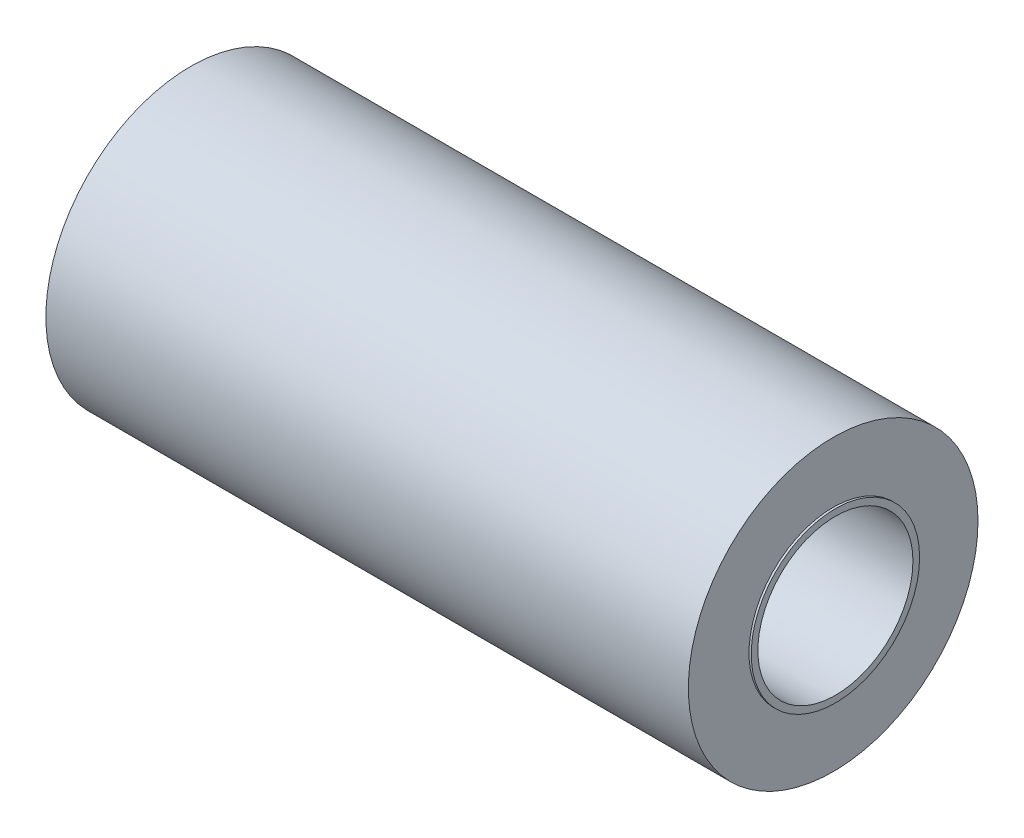
ISO-10303-21;
HEADER;
FILE_DESCRIPTION(('STEP AP214'),'2;1');
FILE_NAME('part.step','',(''),(''),'','','');
FILE_SCHEMA(('AUTOMOTIVE_DESIGN { 1 0 10303 214 1 1 1 1 }'));
ENDSEC;
DATA;
#1=APPLICATION_CONTEXT('core data for automotive mechanical design processes');
#2=APPLICATION_PROTOCOL_DEFINITION('international standard','automotive_design',2000,#1);
#3=PRODUCT_CONTEXT('',#1,'mechanical');
#4=PRODUCT('Part','Part','',(#3));
#5=PRODUCT_RELATED_PRODUCT_CATEGORY('part','',(#4));
#6=PRODUCT_DEFINITION_FORMATION('','',#4);
#7=PRODUCT_DEFINITION_CONTEXT('part definition',#1,'design');
#8=PRODUCT_DEFINITION('design','',#6,#7);
#9=PRODUCT_DEFINITION_SHAPE('','',#8);
#10=(LENGTH_UNIT() NAMED_UNIT(*) SI_UNIT(.MILLI.,.METRE.));
#11=(NAMED_UNIT(*) PLANE_ANGLE_UNIT() SI_UNIT($,.RADIAN.));
#12=(NAMED_UNIT(*) SI_UNIT($,.STERADIAN.) SOLID_ANGLE_UNIT());
#13=UNCERTAINTY_MEASURE_WITH_UNIT(LENGTH_MEASURE(1.E-05),#10,'distance_accuracy_value','');
#14=(GEOMETRIC_REPRESENTATION_CONTEXT(3) GLOBAL_UNCERTAINTY_ASSIGNED_CONTEXT((#13)) GLOBAL_UNIT_ASSIGNED_CONTEXT((#10,
#11,#12)) REPRESENTATION_CONTEXT('',''));
#15=CARTESIAN_POINT('',(0.,0.,0.));
#16=DIRECTION('',(0.,0.,1.));
#17=DIRECTION('',(1.,0.,0.));
#18=AXIS2_PLACEMENT_3D('',#15,#16,#17);
#19=CARTESIAN_POINT('',(-146.,0.,0.));
#20=DIRECTION('',(1.,0.,0.));
#21=DIRECTION('',(0.,0.,-1.));
#22=AXIS2_PLACEMENT_3D('',#19,#20,#21);
#23=CYLINDRICAL_SURFACE('',#22,38.);
#24=CARTESIAN_POINT('',(-146.,0.,0.));
#25=DIRECTION('',(1.,0.,0.));
#26=DIRECTION('',(0.,0.,-1.));
#27=AXIS2_PLACEMENT_3D('',#24,#25,#26);
#28=CIRCLE('',#27,38.);
#29=CARTESIAN_POINT('',(-146.,0.,-38.));
#30=VERTEX_POINT('',#29);
#31=EDGE_CURVE('E55',#30,#30,#28,.T.);
#32=ORIENTED_EDGE('',*,*,#31,.T.);
#33=EDGE_LOOP('',(#32));
#34=FACE_BOUND('',#33,.T.);
#35=CARTESIAN_POINT('',(-145.,0.,0.));
#36=DIRECTION('',(1.,0.,0.));
#37=DIRECTION('',(0.,0.,-1.));
#38=AXIS2_PLACEMENT_3D('',#35,#36,#37);
#39=CIRCLE('',#38,38.);
#40=CARTESIAN_POINT('',(-145.,0.,-38.));
#41=VERTEX_POINT('',#40);
#42=EDGE_CURVE('E79',#41,#41,#39,.T.);
#43=ORIENTED_EDGE('',*,*,#42,.F.);
#44=EDGE_LOOP('',(#43));
#45=FACE_BOUND('',#44,.T.);
#46=ADVANCED_FACE('F47',(#34,#45),#23,.T.);
#47=CARTESIAN_POINT('',(145.,0.,0.));
#48=DIRECTION('',(1.,0.,0.));
#49=DIRECTION('',(0.,0.,-1.));
#50=AXIS2_PLACEMENT_3D('',#47,#48,#49);
#51=CIRCLE('',#50,38.);
#52=CARTESIAN_POINT('',(145.,0.,-38.));
#53=VERTEX_POINT('',#52);
#54=EDGE_CURVE('E10',#53,#53,#51,.F.);
#55=ORIENTED_EDGE('',*,*,#54,.F.);
#56=EDGE_LOOP('',(#55));
#57=FACE_BOUND('',#56,.T.);
#58=CARTESIAN_POINT('',(146.,0.,0.));
#59=DIRECTION('',(1.,0.,0.));
#60=DIRECTION('',(0.,0.,-1.));
#61=AXIS2_PLACEMENT_3D('',#58,#59,#60);
#62=CIRCLE('',#61,38.);
#63=CARTESIAN_POINT('',(146.,0.,-38.));
#64=VERTEX_POINT('',#63);
#65=EDGE_CURVE('E65',#64,#64,#62,.T.);
#66=ORIENTED_EDGE('',*,*,#65,.F.);
#67=EDGE_LOOP('',(#66));
#68=FACE_BOUND('',#67,.T.);
#69=ADVANCED_FACE('F49',(#57,#68),#23,.T.);
#70=CARTESIAN_POINT('',(-146.,0.,0.));
#71=DIRECTION('',(1.,0.,0.));
#72=DIRECTION('',(0.,0.,-1.));
#73=AXIS2_PLACEMENT_3D('',#70,#71,#72);
#74=PLANE('',#73);
#75=CARTESIAN_POINT('',(-146.,0.,0.));
#76=DIRECTION('',(1.,0.,0.));
#77=DIRECTION('',(0.,0.,-1.));
#78=AXIS2_PLACEMENT_3D('',#75,#76,#77);
#79=CIRCLE('',#78,35.);
#80=CARTESIAN_POINT('',(-146.,0.,-35.));
#81=VERTEX_POINT('',#80);
#82=EDGE_CURVE('E60',#81,#81,#79,.T.);
#83=ORIENTED_EDGE('',*,*,#82,.T.);
#84=EDGE_LOOP('',(#83));
#85=FACE_BOUND('',#84,.T.);
#86=ORIENTED_EDGE('',*,*,#31,.F.);
#87=EDGE_LOOP('',(#86));
#88=FACE_BOUND('',#87,.T.);
#89=ADVANCED_FACE('F110',(#85,#88),#74,.F.);
#90=CARTESIAN_POINT('',(-146.,0.,0.));
#91=DIRECTION('',(1.,0.,0.));
#92=DIRECTION('',(0.,0.,-1.));
#93=AXIS2_PLACEMENT_3D('',#90,#91,#92);
#94=CYLINDRICAL_SURFACE('',#93,35.);
#95=ORIENTED_EDGE('',*,*,#82,.F.);
#96=EDGE_LOOP('',(#95));
#97=FACE_BOUND('',#96,.T.);
#98=CARTESIAN_POINT('',(146.,0.,0.));
#99=DIRECTION('',(1.,0.,0.));
#100=DIRECTION('',(0.,0.,-1.));
#101=AXIS2_PLACEMENT_3D('',#98,#99,#100);
#102=CIRCLE('',#101,35.);
#103=CARTESIAN_POINT('',(146.,0.,-35.));
#104=VERTEX_POINT('',#103);
#105=EDGE_CURVE('E71',#104,#104,#102,.T.);
#106=ORIENTED_EDGE('',*,*,#105,.T.);
#107=EDGE_LOOP('',(#106));
#108=FACE_BOUND('',#107,.T.);
#109=ADVANCED_FACE('F103',(#97,#108),#94,.F.);
#110=CARTESIAN_POINT('',(146.,0.,0.));
#111=DIRECTION('',(1.,0.,0.));
#112=DIRECTION('',(0.,0.,-1.));
#113=AXIS2_PLACEMENT_3D('',#110,#111,#112);
#114=PLANE('',#113);
#115=ORIENTED_EDGE('',*,*,#65,.T.);
#116=EDGE_LOOP('',(#115));
#117=FACE_BOUND('',#116,.T.);
#118=ORIENTED_EDGE('',*,*,#105,.F.);
#119=EDGE_LOOP('',(#118));
#120=FACE_BOUND('',#119,.T.);
#121=ADVANCED_FACE('F93',(#117,#120),#114,.T.);
#122=CARTESIAN_POINT('',(-145.,0.,0.));
#123=DIRECTION('',(1.,0.,0.));
#124=DIRECTION('',(0.,0.,-1.));
#125=AXIS2_PLACEMENT_3D('',#122,#123,#124);
#126=CYLINDRICAL_SURFACE('',#125,65.3639227993727);
#127=CARTESIAN_POINT('',(-145.,0.,0.));
#128=DIRECTION('',(1.,0.,0.));
#129=DIRECTION('',(0.,0.,-1.));
#130=AXIS2_PLACEMENT_3D('',#127,#128,#129);
#131=CIRCLE('',#130,65.3639227993727);
#132=CARTESIAN_POINT('',(-145.,0.,-65.3639227993727));
#133=VERTEX_POINT('',#132);
#134=EDGE_CURVE('E75',#133,#133,#131,.T.);
#135=ORIENTED_EDGE('',*,*,#134,.T.);
#136=EDGE_LOOP('',(#135));
#137=FACE_BOUND('',#136,.T.);
#138=CARTESIAN_POINT('',(145.,0.,0.));
#139=DIRECTION('',(1.,0.,0.));
#140=DIRECTION('',(0.,0.,-1.));
#141=AXIS2_PLACEMENT_3D('',#138,#139,#140);
#142=CIRCLE('',#141,65.3639227993727);
#143=CARTESIAN_POINT('',(145.,0.,-65.3639227993727));
#144=VERTEX_POINT('',#143);
#145=EDGE_CURVE('E83',#144,#144,#142,.T.);
#146=ORIENTED_EDGE('',*,*,#145,.F.);
#147=EDGE_LOOP('',(#146));
#148=FACE_BOUND('',#147,.T.);
#149=ADVANCED_FACE('F90',(#137,#148),#126,.T.);
#150=CARTESIAN_POINT('',(-145.,0.,0.));
#151=DIRECTION('',(1.,0.,0.));
#152=DIRECTION('',(0.,0.,-1.));
#153=AXIS2_PLACEMENT_3D('',#150,#151,#152);
#154=PLANE('',#153);
#155=ORIENTED_EDGE('',*,*,#42,.T.);
#156=EDGE_LOOP('',(#155));
#157=FACE_BOUND('',#156,.T.);
#158=ORIENTED_EDGE('',*,*,#134,.F.);
#159=EDGE_LOOP('',(#158));
#160=FACE_BOUND('',#159,.T.);
#161=ADVANCED_FACE('F92',(#157,#160),#154,.F.);
#162=CARTESIAN_POINT('',(145.,0.,0.));
#163=DIRECTION('',(1.,0.,0.));
#164=DIRECTION('',(0.,0.,-1.));
#165=AXIS2_PLACEMENT_3D('',#162,#163,#164);
#166=PLANE('',#165);
#167=ORIENTED_EDGE('',*,*,#145,.T.);
#168=EDGE_LOOP('',(#167));
#169=FACE_BOUND('',#168,.T.);
#170=ORIENTED_EDGE('',*,*,#54,.T.);
#171=EDGE_LOOP('',(#170));
#172=FACE_BOUND('',#171,.T.);
#173=ADVANCED_FACE('F88',(#169,#172),#166,.T.);
#174=CLOSED_SHELL('',(#46,#69,#89,#109,#121,#149,#161,#173));
#175=MANIFOLD_SOLID_BREP('B2',#174);
#176=ADVANCED_BREP_SHAPE_REPRESENTATION('',(#18,#175),#14);
#177=SHAPE_DEFINITION_REPRESENTATION(#9,#176);
ENDSEC;
END-ISO-10303-21;
